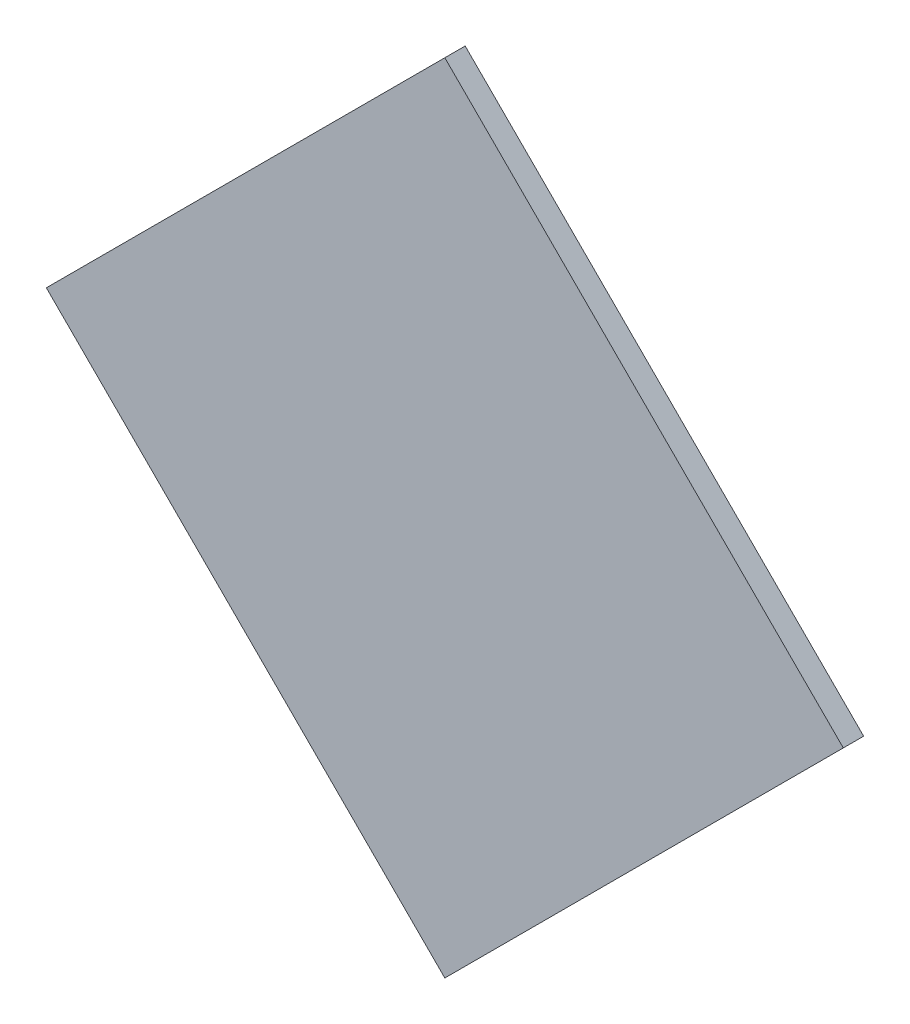
ISO-10303-21;
HEADER;
FILE_DESCRIPTION(('STEP AP214'),'2;1');
FILE_NAME('part.step','',(''),(''),'','','');
FILE_SCHEMA(('AUTOMOTIVE_DESIGN { 1 0 10303 214 1 1 1 1 }'));
ENDSEC;
DATA;
#1=APPLICATION_CONTEXT('core data for automotive mechanical design processes');
#2=APPLICATION_PROTOCOL_DEFINITION('international standard','automotive_design',2000,#1);
#3=PRODUCT_CONTEXT('',#1,'mechanical');
#4=PRODUCT('Part','Part','',(#3));
#5=PRODUCT_RELATED_PRODUCT_CATEGORY('part','',(#4));
#6=PRODUCT_DEFINITION_FORMATION('','',#4);
#7=PRODUCT_DEFINITION_CONTEXT('part definition',#1,'design');
#8=PRODUCT_DEFINITION('design','',#6,#7);
#9=PRODUCT_DEFINITION_SHAPE('','',#8);
#10=(LENGTH_UNIT() NAMED_UNIT(*) SI_UNIT(.MILLI.,.METRE.));
#11=(NAMED_UNIT(*) PLANE_ANGLE_UNIT() SI_UNIT($,.RADIAN.));
#12=(NAMED_UNIT(*) SI_UNIT($,.STERADIAN.) SOLID_ANGLE_UNIT());
#13=UNCERTAINTY_MEASURE_WITH_UNIT(LENGTH_MEASURE(1.E-05),#10,'distance_accuracy_value','');
#14=(GEOMETRIC_REPRESENTATION_CONTEXT(3) GLOBAL_UNCERTAINTY_ASSIGNED_CONTEXT((#13)) GLOBAL_UNIT_ASSIGNED_CONTEXT((#10,
#11,#12)) REPRESENTATION_CONTEXT('',''));
#15=CARTESIAN_POINT('',(0.,0.,0.));
#16=DIRECTION('',(0.,0.,1.));
#17=DIRECTION('',(1.,0.,0.));
#18=AXIS2_PLACEMENT_3D('',#15,#16,#17);
#19=CARTESIAN_POINT('',(4.309398,6.033942,0.76487));
#20=DIRECTION('',(0.,0.,-1.));
#21=DIRECTION('',(-1.,0.,0.));
#22=AXIS2_PLACEMENT_3D('',#19,#20,#21);
#23=PLANE('',#22);
#24=DIRECTION('',(0.707106781186548,0.707106781186548,0.));
#25=VECTOR('',#24,1.);
#26=CARTESIAN_POINT('',(3.637646667,6.033942,0.76487));
#27=LINE('',#26,#25);
#28=CARTESIAN_POINT('',(3.637646667,6.033942,0.76487));
#29=VERTEX_POINT('',#28);
#30=CARTESIAN_POINT('',(4.309398,6.705693333,0.76487));
#31=VERTEX_POINT('',#30);
#32=EDGE_CURVE('E55',#29,#31,#27,.T.);
#33=ORIENTED_EDGE('',*,*,#32,.T.);
#34=DIRECTION('',(0.707106781186548,-0.707106781186548,0.));
#35=VECTOR('',#34,1.);
#36=CARTESIAN_POINT('',(4.309398,6.705693333,0.76487));
#37=LINE('',#36,#35);
#38=CARTESIAN_POINT('',(4.981149333,6.033942,0.76487));
#39=VERTEX_POINT('',#38);
#40=EDGE_CURVE('E57',#31,#39,#37,.T.);
#41=ORIENTED_EDGE('',*,*,#40,.T.);
#42=DIRECTION('',(-0.707106781186548,-0.707106781186548,0.));
#43=VECTOR('',#42,1.);
#44=CARTESIAN_POINT('',(4.981149333,6.033942,0.76487));
#45=LINE('',#44,#43);
#46=CARTESIAN_POINT('',(4.309398,5.362190667,0.76487));
#47=VERTEX_POINT('',#46);
#48=EDGE_CURVE('E20',#39,#47,#45,.T.);
#49=ORIENTED_EDGE('',*,*,#48,.T.);
#50=DIRECTION('',(-0.707106781186548,0.707106781186548,0.));
#51=VECTOR('',#50,1.);
#52=CARTESIAN_POINT('',(4.309398,5.362190667,0.76487));
#53=LINE('',#52,#51);
#54=EDGE_CURVE('E80',#47,#29,#53,.T.);
#55=ORIENTED_EDGE('',*,*,#54,.T.);
#56=EDGE_LOOP('',(#33,#41,#49,#55));
#57=FACE_BOUND('',#56,.T.);
#58=ADVANCED_FACE('F17',(#57),#23,.T.);
#59=CARTESIAN_POINT('',(4.981149333,6.033942,0.76487));
#60=DIRECTION('',(-0.707106781186548,0.707106781186548,0.));
#61=DIRECTION('',(-0.707106781186548,-0.707106781186548,0.));
#62=AXIS2_PLACEMENT_3D('',#59,#60,#61);
#63=PLANE('',#62);
#64=DIRECTION('',(0.,0.,1.));
#65=VECTOR('',#64,1.);
#66=CARTESIAN_POINT('',(4.309398,5.362190667,0.76487));
#67=LINE('',#66,#65);
#68=CARTESIAN_POINT('',(4.309398,5.362190667,0.79916));
#69=VERTEX_POINT('',#68);
#70=EDGE_CURVE('E68',#69,#47,#67,.F.);
#71=ORIENTED_EDGE('',*,*,#70,.T.);
#72=ORIENTED_EDGE('',*,*,#48,.F.);
#73=DIRECTION('',(0.,0.,1.));
#74=VECTOR('',#73,1.);
#75=CARTESIAN_POINT('',(4.981149333,6.033942,0.76487));
#76=LINE('',#75,#74);
#77=CARTESIAN_POINT('',(4.981149333,6.033942,0.79916));
#78=VERTEX_POINT('',#77);
#79=EDGE_CURVE('E63',#39,#78,#76,.T.);
#80=ORIENTED_EDGE('',*,*,#79,.T.);
#81=DIRECTION('',(0.707106781186549,0.707106781186547,0.));
#82=VECTOR('',#81,1.);
#83=CARTESIAN_POINT('',(4.309398,5.362190667,0.79916));
#84=LINE('',#83,#82);
#85=EDGE_CURVE('E83',#69,#78,#84,.T.);
#86=ORIENTED_EDGE('',*,*,#85,.F.);
#87=EDGE_LOOP('',(#71,#72,#80,#86));
#88=FACE_BOUND('',#87,.T.);
#89=ADVANCED_FACE('F65',(#88),#63,.F.);
#90=CARTESIAN_POINT('',(4.309398,6.705693333,0.76487));
#91=DIRECTION('',(-0.707106781186548,-0.707106781186548,0.));
#92=DIRECTION('',(0.707106781186548,-0.707106781186548,0.));
#93=AXIS2_PLACEMENT_3D('',#90,#91,#92);
#94=PLANE('',#93);
#95=ORIENTED_EDGE('',*,*,#79,.F.);
#96=ORIENTED_EDGE('',*,*,#40,.F.);
#97=DIRECTION('',(0.,0.,1.));
#98=VECTOR('',#97,1.);
#99=CARTESIAN_POINT('',(4.309398,6.705693333,0.76487));
#100=LINE('',#99,#98);
#101=CARTESIAN_POINT('',(4.309398,6.705693333,0.79916));
#102=VERTEX_POINT('',#101);
#103=EDGE_CURVE('E75',#31,#102,#100,.T.);
#104=ORIENTED_EDGE('',*,*,#103,.T.);
#105=DIRECTION('',(-0.707106781186547,0.707106781186547,0.));
#106=VECTOR('',#105,1.);
#107=CARTESIAN_POINT('',(4.981149333,6.033942,0.79916));
#108=LINE('',#107,#106);
#109=EDGE_CURVE('E72',#78,#102,#108,.T.);
#110=ORIENTED_EDGE('',*,*,#109,.F.);
#111=EDGE_LOOP('',(#95,#96,#104,#110));
#112=FACE_BOUND('',#111,.T.);
#113=ADVANCED_FACE('F70',(#112),#94,.F.);
#114=CARTESIAN_POINT('',(3.637646667,6.033942,0.76487));
#115=DIRECTION('',(0.707106781186548,-0.707106781186548,0.));
#116=DIRECTION('',(0.707106781186548,0.707106781186548,0.));
#117=AXIS2_PLACEMENT_3D('',#114,#115,#116);
#118=PLANE('',#117);
#119=ORIENTED_EDGE('',*,*,#103,.F.);
#120=ORIENTED_EDGE('',*,*,#32,.F.);
#121=DIRECTION('',(0.,0.,1.));
#122=VECTOR('',#121,1.);
#123=CARTESIAN_POINT('',(3.637646667,6.033942,0.76487));
#124=LINE('',#123,#122);
#125=CARTESIAN_POINT('',(3.637646667,6.033942,0.79916));
#126=VERTEX_POINT('',#125);
#127=EDGE_CURVE('E35',#29,#126,#124,.T.);
#128=ORIENTED_EDGE('',*,*,#127,.T.);
#129=DIRECTION('',(-0.707106781186547,-0.707106781186548,0.));
#130=VECTOR('',#129,1.);
#131=CARTESIAN_POINT('',(4.309398,6.705693333,0.79916));
#132=LINE('',#131,#130);
#133=EDGE_CURVE('E26',#102,#126,#132,.T.);
#134=ORIENTED_EDGE('',*,*,#133,.F.);
#135=EDGE_LOOP('',(#119,#120,#128,#134));
#136=FACE_BOUND('',#135,.T.);
#137=ADVANCED_FACE('F89',(#136),#118,.F.);
#138=CARTESIAN_POINT('',(4.309398,5.362190667,0.76487));
#139=DIRECTION('',(0.707106781186548,0.707106781186548,0.));
#140=DIRECTION('',(-0.707106781186548,0.707106781186548,0.));
#141=AXIS2_PLACEMENT_3D('',#138,#139,#140);
#142=PLANE('',#141);
#143=ORIENTED_EDGE('',*,*,#127,.F.);
#144=ORIENTED_EDGE('',*,*,#54,.F.);
#145=ORIENTED_EDGE('',*,*,#70,.F.);
#146=DIRECTION('',(0.707106781186548,-0.707106781186547,0.));
#147=VECTOR('',#146,1.);
#148=CARTESIAN_POINT('',(3.637646667,6.033942,0.79916));
#149=LINE('',#148,#147);
#150=EDGE_CURVE('E11',#126,#69,#149,.T.);
#151=ORIENTED_EDGE('',*,*,#150,.F.);
#152=EDGE_LOOP('',(#143,#144,#145,#151));
#153=FACE_BOUND('',#152,.T.);
#154=ADVANCED_FACE('F91',(#153),#142,.F.);
#155=CARTESIAN_POINT('',(4.309398,6.033942,0.79916));
#156=DIRECTION('',(0.,0.,1.));
#157=DIRECTION('',(0.,-1.,0.));
#158=AXIS2_PLACEMENT_3D('',#155,#156,#157);
#159=PLANE('',#158);
#160=ORIENTED_EDGE('',*,*,#133,.T.);
#161=ORIENTED_EDGE('',*,*,#150,.T.);
#162=ORIENTED_EDGE('',*,*,#85,.T.);
#163=ORIENTED_EDGE('',*,*,#109,.T.);
#164=EDGE_LOOP('',(#160,#161,#162,#163));
#165=FACE_BOUND('',#164,.T.);
#166=ADVANCED_FACE('F88',(#165),#159,.T.);
#167=CLOSED_SHELL('',(#58,#89,#113,#137,#154,#166));
#168=MANIFOLD_SOLID_BREP('B1',#167);
#169=ADVANCED_BREP_SHAPE_REPRESENTATION('',(#18,#168),#14);
#170=SHAPE_DEFINITION_REPRESENTATION(#9,#169);
ENDSEC;
END-ISO-10303-21;
